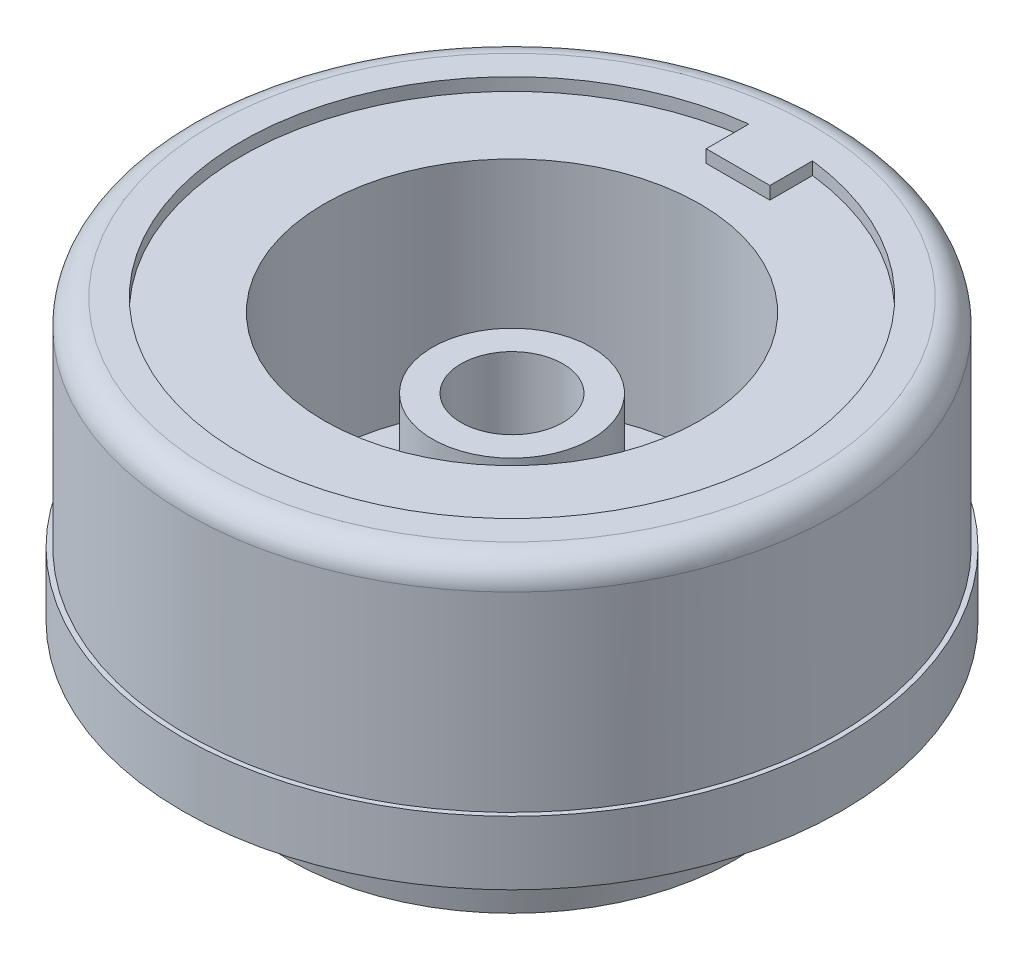
ISO-10303-21;
HEADER;
FILE_DESCRIPTION(('STEP AP214'),'2;1');
FILE_NAME('part.step','',(''),(''),'','','');
FILE_SCHEMA(('AUTOMOTIVE_DESIGN { 1 0 10303 214 1 1 1 1 }'));
ENDSEC;
DATA;
#1=APPLICATION_CONTEXT('core data for automotive mechanical design processes');
#2=APPLICATION_PROTOCOL_DEFINITION('international standard','automotive_design',2000,#1);
#3=PRODUCT_CONTEXT('',#1,'mechanical');
#4=PRODUCT('Part','Part','',(#3));
#5=PRODUCT_RELATED_PRODUCT_CATEGORY('part','',(#4));
#6=PRODUCT_DEFINITION_FORMATION('','',#4);
#7=PRODUCT_DEFINITION_CONTEXT('part definition',#1,'design');
#8=PRODUCT_DEFINITION('design','',#6,#7);
#9=PRODUCT_DEFINITION_SHAPE('','',#8);
#10=(LENGTH_UNIT() NAMED_UNIT(*) SI_UNIT(.MILLI.,.METRE.));
#11=(NAMED_UNIT(*) PLANE_ANGLE_UNIT() SI_UNIT($,.RADIAN.));
#12=(NAMED_UNIT(*) SI_UNIT($,.STERADIAN.) SOLID_ANGLE_UNIT());
#13=UNCERTAINTY_MEASURE_WITH_UNIT(LENGTH_MEASURE(1.E-05),#10,'distance_accuracy_value','');
#14=(GEOMETRIC_REPRESENTATION_CONTEXT(3) GLOBAL_UNCERTAINTY_ASSIGNED_CONTEXT((#13)) GLOBAL_UNIT_ASSIGNED_CONTEXT((#10,
#11,#12)) REPRESENTATION_CONTEXT('',''));
#15=CARTESIAN_POINT('',(0.,0.,0.));
#16=DIRECTION('',(0.,0.,1.));
#17=DIRECTION('',(1.,0.,0.));
#18=AXIS2_PLACEMENT_3D('',#15,#16,#17);
#19=CARTESIAN_POINT('',(9.525,12.963921875,0.));
#20=DIRECTION('',(0.,-1.,0.));
#21=DIRECTION('',(0.,0.,-1.));
#22=AXIS2_PLACEMENT_3D('',#19,#20,#21);
#23=PLANE('',#22);
#24=DIRECTION('',(0.,0.,-1.));
#25=VECTOR('',#24,1.);
#26=CARTESIAN_POINT('',(6.858,12.963921875,13.1455));
#27=LINE('',#26,#25);
#28=CARTESIAN_POINT('',(6.858,12.963921875,9.77157510332904));
#29=VERTEX_POINT('',#28);
#30=CARTESIAN_POINT('',(6.858,12.963921875,6.61010294927394));
#31=VERTEX_POINT('',#30);
#32=EDGE_CURVE('E188',#29,#31,#27,.T.);
#33=ORIENTED_EDGE('',*,*,#32,.T.);
#34=CARTESIAN_POINT('',(0.,12.963921875,0.));
#35=DIRECTION('',(0.,-1.,0.));
#36=DIRECTION('',(0.,0.,-1.));
#37=AXIS2_PLACEMENT_3D('',#34,#35,#36);
#38=CIRCLE('',#37,9.525);
#39=CARTESIAN_POINT('',(0.,12.963921875,9.525));
#40=VERTEX_POINT('',#39);
#41=EDGE_CURVE('E424',#40,#31,#38,.T.);
#42=ORIENTED_EDGE('',*,*,#41,.F.);
#43=DIRECTION('',(0.,0.,1.));
#44=VECTOR('',#43,1.);
#45=CARTESIAN_POINT('',(0.,12.963921875,0.));
#46=LINE('',#45,#44);
#47=CARTESIAN_POINT('',(0.,12.963921875,11.938));
#48=VERTEX_POINT('',#47);
#49=EDGE_CURVE('E949',#40,#48,#46,.T.);
#50=ORIENTED_EDGE('',*,*,#49,.T.);
#51=CARTESIAN_POINT('',(0.,12.963921875,0.));
#52=DIRECTION('',(0.,-1.,0.));
#53=DIRECTION('',(0.,0.,-1.));
#54=AXIS2_PLACEMENT_3D('',#51,#52,#53);
#55=CIRCLE('',#54,11.938);
#56=EDGE_CURVE('E173',#48,#29,#55,.T.);
#57=ORIENTED_EDGE('',*,*,#56,.T.);
#58=EDGE_LOOP('',(#33,#42,#50,#57));
#59=FACE_BOUND('',#58,.T.);
#60=ADVANCED_FACE('F43',(#59),#23,.T.);
#61=CARTESIAN_POINT('',(7.493,0.,0.));
#62=DIRECTION('',(0.,-1.,0.));
#63=DIRECTION('',(0.,0.,-1.));
#64=AXIS2_PLACEMENT_3D('',#61,#62,#63);
#65=PLANE('',#64);
#66=CARTESIAN_POINT('',(0.,0.,0.));
#67=DIRECTION('',(0.,-1.,0.));
#68=DIRECTION('',(0.,0.,-1.));
#69=AXIS2_PLACEMENT_3D('',#66,#67,#68);
#70=CIRCLE('',#69,8.89);
#71=CARTESIAN_POINT('',(-6.80185999428062,0.,5.72422925975234));
#72=VERTEX_POINT('',#71);
#73=CARTESIAN_POINT('',(-5.72422925975232,0.,6.80185999428064));
#74=VERTEX_POINT('',#73);
#75=EDGE_CURVE('E467',#72,#74,#70,.T.);
#76=ORIENTED_EDGE('',*,*,#75,.T.);
#77=DIRECTION('',(0.707106781186546,0.,-0.707106781186549));
#78=VECTOR('',#77,1.);
#79=CARTESIAN_POINT('',(-6.17478951387086,0.,7.25242024839918));
#80=LINE('',#79,#78);
#81=CARTESIAN_POINT('',(-4.73206714897541,0.,5.80969788350373));
#82=VERTEX_POINT('',#81);
#83=EDGE_CURVE('E253',#74,#82,#80,.T.);
#84=ORIENTED_EDGE('',*,*,#83,.T.);
#85=CARTESIAN_POINT('',(0.,0.,0.));
#86=DIRECTION('',(0.,-1.,0.));
#87=DIRECTION('',(0.,0.,-1.));
#88=AXIS2_PLACEMENT_3D('',#85,#86,#87);
#89=CIRCLE('',#88,7.493);
#90=CARTESIAN_POINT('',(-5.80969788350371,0.,4.73206714897543));
#91=VERTEX_POINT('',#90);
#92=EDGE_CURVE('E426',#91,#82,#89,.T.);
#93=ORIENTED_EDGE('',*,*,#92,.F.);
#94=DIRECTION('',(0.707106781186547,0.,-0.707106781186548));
#95=VECTOR('',#94,1.);
#96=CARTESIAN_POINT('',(-7.25242024839916,0.,6.17478951387088));
#97=LINE('',#96,#95);
#98=EDGE_CURVE('E247',#72,#91,#97,.T.);
#99=ORIENTED_EDGE('',*,*,#98,.F.);
#100=EDGE_LOOP('',(#76,#84,#93,#99));
#101=FACE_BOUND('',#100,.T.);
#102=ADVANCED_FACE('F331',(#101),#65,.T.);
#103=CARTESIAN_POINT('',(0.,0.,0.));
#104=DIRECTION('',(0.,-1.,0.));
#105=DIRECTION('',(0.,0.,-1.));
#106=AXIS2_PLACEMENT_3D('',#103,#104,#105);
#107=CYLINDRICAL_SURFACE('',#106,7.493);
#108=ORIENTED_EDGE('',*,*,#92,.T.);
#109=DIRECTION('',(0.,-1.,0.));
#110=VECTOR('',#109,1.);
#111=CARTESIAN_POINT('',(-4.73206714897541,6.86631753517413,5.80969788350373));
#112=LINE('',#111,#110);
#113=CARTESIAN_POINT('',(-4.73206714897541,3.302,5.80969788350373));
#114=VERTEX_POINT('',#113);
#115=EDGE_CURVE('E251',#114,#82,#112,.T.);
#116=ORIENTED_EDGE('',*,*,#115,.F.);
#117=CARTESIAN_POINT('',(0.,3.302,0.));
#118=DIRECTION('',(0.,-1.,0.));
#119=DIRECTION('',(0.,0.,-1.));
#120=AXIS2_PLACEMENT_3D('',#117,#118,#119);
#121=CIRCLE('',#120,7.493);
#122=CARTESIAN_POINT('',(-5.80969788350371,3.302,4.73206714897543));
#123=VERTEX_POINT('',#122);
#124=EDGE_CURVE('E429',#123,#114,#121,.T.);
#125=ORIENTED_EDGE('',*,*,#124,.F.);
#126=DIRECTION('',(0.,-1.,0.));
#127=VECTOR('',#126,1.);
#128=CARTESIAN_POINT('',(-5.80969788350371,6.86631753517413,4.73206714897543));
#129=LINE('',#128,#127);
#130=EDGE_CURVE('E256',#123,#91,#129,.T.);
#131=ORIENTED_EDGE('',*,*,#130,.T.);
#132=EDGE_LOOP('',(#108,#116,#125,#131));
#133=FACE_BOUND('',#132,.T.);
#134=ADVANCED_FACE('F337',(#133),#107,.F.);
#135=CARTESIAN_POINT('',(0.,1.905,0.));
#136=DIRECTION('',(0.,1.,0.));
#137=DIRECTION('',(0.,0.,1.));
#138=AXIS2_PLACEMENT_3D('',#135,#136,#137);
#139=CONICAL_SURFACE('',#138,9.144,0.132551532296673);
#140=CARTESIAN_POINT('',(-5.72421033391964,-0.000199999999999538,6.80184106844796));
#141=CARTESIAN_POINT('',(-5.75426130483428,0.317366100510191,6.8318920393626));
#142=CARTESIAN_POINT('',(-5.78431077987055,0.63493248409872,6.86194151439887));
#143=CARTESIAN_POINT('',(-5.84440673818632,1.27006581743205,6.92203747271464));
#144=CARTESIAN_POINT('',(-5.87445322146582,1.58763276717686,6.95208395599414));
#145=CARTESIAN_POINT('',(-5.90449820886695,1.9052,6.98212894339528));
#146=B_SPLINE_CURVE_WITH_KNOTS('',3,(#140,#141,#142,#143,#144,#145),.UNSPECIFIED.,.F.,.F.,(4,2,
4),(0.,0.961191525643388,1.92238305128557),.UNSPECIFIED.);
#147=CARTESIAN_POINT('',(-5.90447928687048,1.905,6.9821100213988));
#148=VERTEX_POINT('',#147);
#149=EDGE_CURVE('E271',#74,#148,#146,.T.);
#150=ORIENTED_EDGE('',*,*,#149,.F.);
#151=ORIENTED_EDGE('',*,*,#75,.F.);
#152=CARTESIAN_POINT('',(-6.80184106844794,-0.000200000000000001,5.72421033391967));
#153=CARTESIAN_POINT('',(-6.83189203936258,0.317366100510191,5.7542613048343));
#154=CARTESIAN_POINT('',(-6.86194151439885,0.63493248409872,5.78431077987057));
#155=CARTESIAN_POINT('',(-6.92203747271462,1.27006581743205,5.84440673818634));
#156=CARTESIAN_POINT('',(-6.95208395599412,1.58763276717686,5.87445322146584));
#157=CARTESIAN_POINT('',(-6.98212894339525,1.9052,5.90449820886698));
#158=B_SPLINE_CURVE_WITH_KNOTS('',3,(#152,#153,#154,#155,#156,#157),.UNSPECIFIED.,.F.,.F.,(4,2,
4),(0.,0.961191525643388,1.92238305128557),.UNSPECIFIED.);
#159=CARTESIAN_POINT('',(-6.98211002139878,1.905,5.9044792868705));
#160=VERTEX_POINT('',#159);
#161=EDGE_CURVE('E262',#72,#160,#158,.T.);
#162=ORIENTED_EDGE('',*,*,#161,.T.);
#163=CARTESIAN_POINT('',(0.,1.905,0.));
#164=DIRECTION('',(0.,-1.,0.));
#165=DIRECTION('',(0.,0.,-1.));
#166=AXIS2_PLACEMENT_3D('',#163,#164,#165);
#167=CIRCLE('',#166,9.144);
#168=EDGE_CURVE('E458',#160,#148,#167,.T.);
#169=ORIENTED_EDGE('',*,*,#168,.T.);
#170=EDGE_LOOP('',(#150,#151,#162,#169));
#171=FACE_BOUND('',#170,.T.);
#172=ADVANCED_FACE('F278',(#171),#139,.T.);
#173=CARTESIAN_POINT('',(0.,3.81992187499999,0.));
#174=DIRECTION('',(0.,1.,0.));
#175=DIRECTION('',(0.,0.,1.));
#176=AXIS2_PLACEMENT_3D('',#173,#174,#175);
#177=CONICAL_SURFACE('',#176,9.525,0.196398948659007);
#178=CARTESIAN_POINT('',(0.,3.81992187499999,0.));
#179=DIRECTION('',(0.,-1.,0.));
#180=DIRECTION('',(0.,0.,-1.));
#181=AXIS2_PLACEMENT_3D('',#178,#179,#180);
#182=CIRCLE('',#181,9.525);
#183=CARTESIAN_POINT('',(0.,3.81992187499999,-9.525));
#184=VERTEX_POINT('',#183);
#185=EDGE_CURVE('E454',#184,#184,#182,.T.);
#186=ORIENTED_EDGE('',*,*,#185,.T.);
#187=EDGE_LOOP('',(#186));
#188=FACE_BOUND('',#187,.T.);
#189=CARTESIAN_POINT('',(-5.90445105093719,1.9048,6.98208178546551));
#190=CARTESIAN_POINT('',(-5.9373316165662,2.13769909295494,7.01496235109452));
#191=CARTESIAN_POINT('',(-5.97021057583967,2.37059863943257,7.04784131036799));
#192=CARTESIAN_POINT('',(-6.03596528167542,2.83639863943257,7.11359601620374));
#193=CARTESIAN_POINT('',(-6.06884102823771,3.06929909295494,7.14647176276604));
#194=CARTESIAN_POINT('',(-6.10171516844446,3.3022,7.17934590297278));
#195=B_SPLINE_CURVE_WITH_KNOTS('',3,(#189,#190,#191,#192,#193,#194),.UNSPECIFIED.,.F.,.F.,(4,2,
4),(0.,0.712487372574213,1.4249747451464),.UNSPECIFIED.);
#196=CARTESIAN_POINT('',(-6.10168693824932,3.302,7.17931767277764));
#197=VERTEX_POINT('',#196);
#198=EDGE_CURVE('E52',#148,#197,#195,.T.);
#199=ORIENTED_EDGE('',*,*,#198,.F.);
#200=ORIENTED_EDGE('',*,*,#168,.F.);
#201=CARTESIAN_POINT('',(-6.98208178546549,1.9048,5.90445105093721));
#202=CARTESIAN_POINT('',(-7.0149623510945,2.13769909295494,5.93733161656622));
#203=CARTESIAN_POINT('',(-7.04784131036797,2.37059863943257,5.97021057583969));
#204=CARTESIAN_POINT('',(-7.11359601620373,2.83639863943257,6.03596528167545));
#205=CARTESIAN_POINT('',(-7.14647176276601,3.06929909295494,6.06884102823774));
#206=CARTESIAN_POINT('',(-7.17934590297276,3.3022,6.10171516844449));
#207=B_SPLINE_CURVE_WITH_KNOTS('',3,(#201,#202,#203,#204,#205,#206),.UNSPECIFIED.,.F.,.F.,(4,2,
4),(0.,0.712487372574213,1.4249747451464),.UNSPECIFIED.);
#208=CARTESIAN_POINT('',(-7.17931767277762,3.302,6.10168693824935));
#209=VERTEX_POINT('',#208);
#210=EDGE_CURVE('E293',#160,#209,#207,.T.);
#211=ORIENTED_EDGE('',*,*,#210,.T.);
#212=CARTESIAN_POINT('',(0.,3.302,0.));
#213=DIRECTION('',(0.,-1.,0.));
#214=DIRECTION('',(0.,0.,-1.));
#215=AXIS2_PLACEMENT_3D('',#212,#213,#214);
#216=CIRCLE('',#215,9.42195233160622);
#217=EDGE_CURVE('E300',#197,#209,#216,.T.);
#218=ORIENTED_EDGE('',*,*,#217,.F.);
#219=EDGE_LOOP('',(#199,#200,#211,#218));
#220=FACE_BOUND('',#219,.T.);
#221=ADVANCED_FACE('F306',(#188,#220),#177,.T.);
#222=CARTESIAN_POINT('',(0.,0.,0.));
#223=DIRECTION('',(0.,-1.,0.));
#224=DIRECTION('',(0.,0.,-1.));
#225=AXIS2_PLACEMENT_3D('',#222,#223,#224);
#226=CYLINDRICAL_SURFACE('',#225,7.493);
#227=CARTESIAN_POINT('',(0.,14.478,0.));
#228=DIRECTION('',(0.,1.,0.));
#229=DIRECTION('',(0.,0.,1.));
#230=AXIS2_PLACEMENT_3D('',#227,#228,#229);
#231=CIRCLE('',#230,7.493);
#232=CARTESIAN_POINT('',(0.,14.478,7.493));
#233=VERTEX_POINT('',#232);
#234=EDGE_CURVE('E470',#233,#233,#231,.T.);
#235=ORIENTED_EDGE('',*,*,#234,.T.);
#236=EDGE_LOOP('',(#235));
#237=FACE_BOUND('',#236,.T.);
#238=CARTESIAN_POINT('',(0.,5.842,0.));
#239=DIRECTION('',(0.,-1.,0.));
#240=DIRECTION('',(0.,0.,-1.));
#241=AXIS2_PLACEMENT_3D('',#238,#239,#240);
#242=CIRCLE('',#241,7.493);
#243=CARTESIAN_POINT('',(0.,5.842,-7.493));
#244=VERTEX_POINT('',#243);
#245=EDGE_CURVE('E406',#244,#244,#242,.T.);
#246=ORIENTED_EDGE('',*,*,#245,.T.);
#247=EDGE_LOOP('',(#246));
#248=FACE_BOUND('',#247,.T.);
#249=ADVANCED_FACE('F310',(#237,#248),#226,.F.);
#250=CARTESIAN_POINT('',(0.,0.,0.));
#251=DIRECTION('',(0.,-1.,0.));
#252=DIRECTION('',(0.,0.,-1.));
#253=AXIS2_PLACEMENT_3D('',#250,#251,#252);
#254=CYLINDRICAL_SURFACE('',#253,12.954);
#255=CARTESIAN_POINT('',(0.,13.97,0.));
#256=DIRECTION('',(0.,1.,0.));
#257=DIRECTION('',(0.,0.,1.));
#258=AXIS2_PLACEMENT_3D('',#255,#256,#257);
#259=CIRCLE('',#258,12.954);
#260=CARTESIAN_POINT('',(0.,13.97,12.954));
#261=VERTEX_POINT('',#260);
#262=EDGE_CURVE('E398',#261,#261,#259,.F.);
#263=ORIENTED_EDGE('',*,*,#262,.T.);
#264=EDGE_LOOP('',(#263));
#265=FACE_BOUND('',#264,.T.);
#266=CARTESIAN_POINT('',(0.,6.35992187499999,0.));
#267=DIRECTION('',(0.,-1.,0.));
#268=DIRECTION('',(0.,0.,-1.));
#269=AXIS2_PLACEMENT_3D('',#266,#267,#268);
#270=CIRCLE('',#269,12.954);
#271=CARTESIAN_POINT('',(0.,6.35992187499999,-12.954));
#272=VERTEX_POINT('',#271);
#273=EDGE_CURVE('E418',#272,#272,#270,.T.);
#274=ORIENTED_EDGE('',*,*,#273,.F.);
#275=EDGE_LOOP('',(#274));
#276=FACE_BOUND('',#275,.T.);
#277=ADVANCED_FACE('F379',(#265,#276),#254,.T.);
#278=CARTESIAN_POINT('',(12.954,14.986,0.));
#279=DIRECTION('',(0.,1.,0.));
#280=DIRECTION('',(0.,0.,1.));
#281=AXIS2_PLACEMENT_3D('',#278,#279,#280);
#282=PLANE('',#281);
#283=DIRECTION('',(0.,0.,-1.));
#284=VECTOR('',#283,1.);
#285=CARTESIAN_POINT('',(1.27,14.986,-9.017));
#286=LINE('',#285,#284);
#287=CARTESIAN_POINT('',(1.27,14.986,-9.017));
#288=VERTEX_POINT('',#287);
#289=CARTESIAN_POINT('',(1.27,14.986,-10.7200338152452));
#290=VERTEX_POINT('',#289);
#291=EDGE_CURVE('E486',#288,#290,#286,.T.);
#292=ORIENTED_EDGE('',*,*,#291,.T.);
#293=CARTESIAN_POINT('',(0.,14.986,0.));
#294=DIRECTION('',(0.,1.,0.));
#295=DIRECTION('',(0.,0.,1.));
#296=AXIS2_PLACEMENT_3D('',#293,#294,#295);
#297=CIRCLE('',#296,10.795);
#298=CARTESIAN_POINT('',(-1.27,14.986,-10.7200338152452));
#299=VERTEX_POINT('',#298);
#300=EDGE_CURVE('E473',#299,#290,#297,.T.);
#301=ORIENTED_EDGE('',*,*,#300,.F.);
#302=DIRECTION('',(0.,0.,1.));
#303=VECTOR('',#302,1.);
#304=CARTESIAN_POINT('',(-1.27,14.986,-10.7200338152452));
#305=LINE('',#304,#303);
#306=CARTESIAN_POINT('',(-1.27,14.986,-9.017));
#307=VERTEX_POINT('',#306);
#308=EDGE_CURVE('E477',#299,#307,#305,.T.);
#309=ORIENTED_EDGE('',*,*,#308,.T.);
#310=DIRECTION('',(1.,0.,0.));
#311=VECTOR('',#310,1.);
#312=CARTESIAN_POINT('',(-1.27,14.986,-9.017));
#313=LINE('',#312,#311);
#314=EDGE_CURVE('E489',#307,#288,#313,.T.);
#315=ORIENTED_EDGE('',*,*,#314,.T.);
#316=EDGE_LOOP('',(#292,#301,#309,#315));
#317=FACE_BOUND('',#316,.T.);
#318=CARTESIAN_POINT('',(0.,14.986,0.));
#319=DIRECTION('',(0.,1.,0.));
#320=DIRECTION('',(0.,0.,1.));
#321=AXIS2_PLACEMENT_3D('',#318,#319,#320);
#322=CIRCLE('',#321,11.938);
#323=CARTESIAN_POINT('',(0.,14.986,11.938));
#324=VERTEX_POINT('',#323);
#325=EDGE_CURVE('E401',#324,#324,#322,.T.);
#326=ORIENTED_EDGE('',*,*,#325,.T.);
#327=EDGE_LOOP('',(#326));
#328=FACE_BOUND('',#327,.T.);
#329=ADVANCED_FACE('F375',(#317,#328),#282,.T.);
#330=CARTESIAN_POINT('',(7.493,5.842,0.));
#331=DIRECTION('',(0.,1.,0.));
#332=DIRECTION('',(0.,0.,1.));
#333=AXIS2_PLACEMENT_3D('',#330,#331,#332);
#334=PLANE('',#333);
#335=CARTESIAN_POINT('',(0.,5.842,0.));
#336=DIRECTION('',(0.,-1.,0.));
#337=DIRECTION('',(0.,0.,-1.));
#338=AXIS2_PLACEMENT_3D('',#335,#336,#337);
#339=CIRCLE('',#338,3.175);
#340=CARTESIAN_POINT('',(0.,5.842,-3.175));
#341=VERTEX_POINT('',#340);
#342=EDGE_CURVE('E438',#341,#341,#339,.T.);
#343=ORIENTED_EDGE('',*,*,#342,.T.);
#344=EDGE_LOOP('',(#343));
#345=FACE_BOUND('',#344,.T.);
#346=ORIENTED_EDGE('',*,*,#245,.F.);
#347=EDGE_LOOP('',(#346));
#348=FACE_BOUND('',#347,.T.);
#349=ADVANCED_FACE('F371',(#345,#348),#334,.T.);
#350=CARTESIAN_POINT('',(0.,0.,0.));
#351=DIRECTION('',(0.,-1.,0.));
#352=DIRECTION('',(0.,0.,-1.));
#353=AXIS2_PLACEMENT_3D('',#350,#351,#352);
#354=CYLINDRICAL_SURFACE('',#353,3.175);
#355=CARTESIAN_POINT('',(0.,11.684,0.));
#356=DIRECTION('',(0.,-1.,0.));
#357=DIRECTION('',(0.,0.,-1.));
#358=AXIS2_PLACEMENT_3D('',#355,#356,#357);
#359=CIRCLE('',#358,3.175);
#360=CARTESIAN_POINT('',(0.,11.684,-3.175));
#361=VERTEX_POINT('',#360);
#362=EDGE_CURVE('E435',#361,#361,#359,.T.);
#363=ORIENTED_EDGE('',*,*,#362,.T.);
#364=EDGE_LOOP('',(#363));
#365=FACE_BOUND('',#364,.T.);
#366=ORIENTED_EDGE('',*,*,#342,.F.);
#367=EDGE_LOOP('',(#366));
#368=FACE_BOUND('',#367,.T.);
#369=ADVANCED_FACE('F367',(#365,#368),#354,.T.);
#370=CARTESIAN_POINT('',(3.175,11.684,0.));
#371=DIRECTION('',(0.,1.,0.));
#372=DIRECTION('',(0.,0.,1.));
#373=AXIS2_PLACEMENT_3D('',#370,#371,#372);
#374=PLANE('',#373);
#375=CARTESIAN_POINT('',(0.,11.684,0.));
#376=DIRECTION('',(0.,-1.,0.));
#377=DIRECTION('',(0.,0.,-1.));
#378=AXIS2_PLACEMENT_3D('',#375,#376,#377);
#379=CIRCLE('',#378,2.032);
#380=CARTESIAN_POINT('',(0.,11.684,-2.032));
#381=VERTEX_POINT('',#380);
#382=EDGE_CURVE('E432',#381,#381,#379,.T.);
#383=ORIENTED_EDGE('',*,*,#382,.T.);
#384=EDGE_LOOP('',(#383));
#385=FACE_BOUND('',#384,.T.);
#386=ORIENTED_EDGE('',*,*,#362,.F.);
#387=EDGE_LOOP('',(#386));
#388=FACE_BOUND('',#387,.T.);
#389=ADVANCED_FACE('F363',(#385,#388),#374,.T.);
#390=CARTESIAN_POINT('',(0.,0.,0.));
#391=DIRECTION('',(0.,-1.,0.));
#392=DIRECTION('',(0.,0.,-1.));
#393=AXIS2_PLACEMENT_3D('',#390,#391,#392);
#394=CYLINDRICAL_SURFACE('',#393,2.032);
#395=ORIENTED_EDGE('',*,*,#382,.F.);
#396=EDGE_LOOP('',(#395));
#397=FACE_BOUND('',#396,.T.);
#398=CARTESIAN_POINT('',(0.,3.048,0.));
#399=DIRECTION('',(0.,-1.,0.));
#400=DIRECTION('',(0.,0.,-1.));
#401=AXIS2_PLACEMENT_3D('',#398,#399,#400);
#402=CIRCLE('',#401,2.032);
#403=CARTESIAN_POINT('',(0.,3.048,-2.032));
#404=VERTEX_POINT('',#403);
#405=EDGE_CURVE('E452',#404,#404,#402,.T.);
#406=ORIENTED_EDGE('',*,*,#405,.T.);
#407=EDGE_LOOP('',(#406));
#408=FACE_BOUND('',#407,.T.);
#409=ADVANCED_FACE('F353',(#397,#408),#394,.F.);
#410=CARTESIAN_POINT('',(2.032,3.302,0.));
#411=DIRECTION('',(0.,-1.,0.));
#412=DIRECTION('',(0.,0.,-1.));
#413=AXIS2_PLACEMENT_3D('',#410,#411,#412);
#414=PLANE('',#413);
#415=CARTESIAN_POINT('',(0.,3.302,0.));
#416=DIRECTION('',(0.,-1.,0.));
#417=DIRECTION('',(0.,0.,-1.));
#418=AXIS2_PLACEMENT_3D('',#415,#416,#417);
#419=CIRCLE('',#418,5.969);
#420=CARTESIAN_POINT('',(0.,3.302,-5.969));
#421=VERTEX_POINT('',#420);
#422=EDGE_CURVE('E403',#421,#421,#419,.T.);
#423=ORIENTED_EDGE('',*,*,#422,.F.);
#424=EDGE_LOOP('',(#423));
#425=FACE_BOUND('',#424,.T.);
#426=ORIENTED_EDGE('',*,*,#124,.T.);
#427=DIRECTION('',(-0.707106781186546,0.,0.707106781186549));
#428=VECTOR('',#427,1.);
#429=CARTESIAN_POINT('',(-6.17478951387086,3.302,7.25242024839918));
#430=LINE('',#429,#428);
#431=EDGE_CURVE('E248',#114,#197,#430,.T.);
#432=ORIENTED_EDGE('',*,*,#431,.T.);
#433=ORIENTED_EDGE('',*,*,#217,.T.);
#434=DIRECTION('',(-0.707106781186547,0.,0.707106781186548));
#435=VECTOR('',#434,1.);
#436=CARTESIAN_POINT('',(-7.25242024839916,3.302,6.17478951387088));
#437=LINE('',#436,#435);
#438=EDGE_CURVE('E250',#123,#209,#437,.T.);
#439=ORIENTED_EDGE('',*,*,#438,.F.);
#440=EDGE_LOOP('',(#426,#432,#433,#439));
#441=FACE_BOUND('',#440,.T.);
#442=ADVANCED_FACE('F349',(#425,#441),#414,.T.);
#443=CARTESIAN_POINT('',(0.,0.,0.));
#444=DIRECTION('',(0.,-1.,0.));
#445=DIRECTION('',(0.,0.,-1.));
#446=AXIS2_PLACEMENT_3D('',#443,#444,#445);
#447=CYLINDRICAL_SURFACE('',#446,9.525);
#448=DIRECTION('',(0.,-1.,0.));
#449=VECTOR('',#448,1.);
#450=CARTESIAN_POINT('',(6.858,0.,6.61010294927393));
#451=LINE('',#450,#449);
#452=CARTESIAN_POINT('',(6.858,6.86792187500002,6.61010294927393));
#453=VERTEX_POINT('',#452);
#454=EDGE_CURVE('E59',#453,#31,#451,.F.);
#455=ORIENTED_EDGE('',*,*,#454,.F.);
#456=CARTESIAN_POINT('',(0.,6.86792187500002,0.));
#457=DIRECTION('',(0.,1.,0.));
#458=DIRECTION('',(0.,0.,1.));
#459=AXIS2_PLACEMENT_3D('',#456,#457,#458);
#460=CIRCLE('',#459,9.525);
#461=CARTESIAN_POINT('',(5.334,6.86792187500002,7.89139208251624));
#462=VERTEX_POINT('',#461);
#463=EDGE_CURVE('E64',#462,#453,#460,.T.);
#464=ORIENTED_EDGE('',*,*,#463,.F.);
#465=DIRECTION('',(0.,-1.,0.));
#466=VECTOR('',#465,1.);
#467=CARTESIAN_POINT('',(5.334,0.,7.89139208251624));
#468=LINE('',#467,#466);
#469=CARTESIAN_POINT('',(5.334,12.963921875,7.89139208251624));
#470=VERTEX_POINT('',#469);
#471=EDGE_CURVE('E955',#470,#462,#468,.T.);
#472=ORIENTED_EDGE('',*,*,#471,.F.);
#473=CARTESIAN_POINT('',(1.524,12.963921875,9.40228956159084));
#474=VERTEX_POINT('',#473);
#475=EDGE_CURVE('E180',#470,#474,#38,.T.);
#476=ORIENTED_EDGE('',*,*,#475,.T.);
#477=DIRECTION('',(0.,-1.,0.));
#478=VECTOR('',#477,1.);
#479=CARTESIAN_POINT('',(1.524,0.,9.40228956159084));
#480=LINE('',#479,#478);
#481=CARTESIAN_POINT('',(1.524,6.86792187499999,9.40228956159084));
#482=VERTEX_POINT('',#481);
#483=EDGE_CURVE('E242',#482,#474,#480,.F.);
#484=ORIENTED_EDGE('',*,*,#483,.F.);
#485=CARTESIAN_POINT('',(0.,6.86792187499999,0.));
#486=DIRECTION('',(0.,-1.,0.));
#487=DIRECTION('',(0.,0.,-1.));
#488=AXIS2_PLACEMENT_3D('',#485,#486,#487);
#489=CIRCLE('',#488,9.525);
#490=CARTESIAN_POINT('',(0.,6.86792187499999,9.525));
#491=VERTEX_POINT('',#490);
#492=EDGE_CURVE('E245',#491,#482,#489,.F.);
#493=ORIENTED_EDGE('',*,*,#492,.F.);
#494=DIRECTION('',(0.,-1.,0.));
#495=VECTOR('',#494,1.);
#496=CARTESIAN_POINT('',(0.,0.,9.525));
#497=LINE('',#496,#495);
#498=EDGE_CURVE('E239',#491,#40,#497,.F.);
#499=ORIENTED_EDGE('',*,*,#498,.T.);
#500=ORIENTED_EDGE('',*,*,#41,.T.);
#501=EDGE_LOOP('',(#455,#464,#472,#476,#484,#493,#499,#500));
#502=FACE_BOUND('',#501,.T.);
#503=ORIENTED_EDGE('',*,*,#185,.F.);
#504=EDGE_LOOP('',(#503));
#505=FACE_BOUND('',#504,.T.);
#506=ADVANCED_FACE('F343',(#502,#505),#447,.T.);
#507=DIRECTION('',(0.,0.,-1.));
#508=VECTOR('',#507,1.);
#509=CARTESIAN_POINT('',(5.334,12.963921875,13.1455));
#510=LINE('',#509,#508);
#511=CARTESIAN_POINT('',(5.334,12.963921875,10.6800883891473));
#512=VERTEX_POINT('',#511);
#513=EDGE_CURVE('E178',#512,#470,#510,.T.);
#514=ORIENTED_EDGE('',*,*,#513,.F.);
#515=CARTESIAN_POINT('',(1.524,12.963921875,11.8403238131396));
#516=VERTEX_POINT('',#515);
#517=EDGE_CURVE('E162',#512,#516,#55,.T.);
#518=ORIENTED_EDGE('',*,*,#517,.T.);
#519=DIRECTION('',(0.,0.,1.));
#520=VECTOR('',#519,1.);
#521=CARTESIAN_POINT('',(1.524,12.963921875,0.));
#522=LINE('',#521,#520);
#523=EDGE_CURVE('E238',#474,#516,#522,.T.);
#524=ORIENTED_EDGE('',*,*,#523,.F.);
#525=ORIENTED_EDGE('',*,*,#475,.F.);
#526=EDGE_LOOP('',(#514,#518,#524,#525));
#527=FACE_BOUND('',#526,.T.);
#528=ADVANCED_FACE('F179',(#527),#23,.T.);
#529=CARTESIAN_POINT('',(0.,12.963921875,0.));
#530=DIRECTION('',(0.,-1.,0.));
#531=DIRECTION('',(0.,0.,-1.));
#532=AXIS2_PLACEMENT_3D('',#529,#530,#531);
#533=CONICAL_SURFACE('',#532,11.938,0.0349065850398867);
#534=CARTESIAN_POINT('',(6.858,-5.72010347816264,10.5587656794319));
#535=CARTESIAN_POINT('',(6.858,-3.49653561043503,10.4661747788413));
#536=CARTESIAN_POINT('',(6.858,-1.27298264079779,10.3732255546477));
#537=CARTESIAN_POINT('',(6.858,3.17409012657347,10.1865447904481));
#538=CARTESIAN_POINT('',(6.858,5.39760992431231,10.092813250557));
#539=CARTESIAN_POINT('',(6.858,9.84461367723485,9.90450215699885));
#540=CARTESIAN_POINT('',(6.858,12.0680976324177,9.80992260331236));
#541=CARTESIAN_POINT('',(6.858,16.5150262427414,9.61983655845105));
#542=CARTESIAN_POINT('',(6.858,18.7384708978764,9.52433006713981));
#543=CARTESIAN_POINT('',(6.858,20.9618938723972,9.42832065800642));
#544=B_SPLINE_CURVE_WITH_KNOTS('',3,(#534,#535,#536,#537,#538,#539,#540,#541,#542,#543),
.UNSPECIFIED.,.F.,.F.,(4,2,2,2,4),(0.,6.67648442550126,13.3529678687095,20.0294514643755,
26.7059360426302),.UNSPECIFIED.);
#545=CARTESIAN_POINT('',(6.858,6.86792187500002,10.0305357848978));
#546=VERTEX_POINT('',#545);
#547=EDGE_CURVE('E183',#546,#29,#544,.T.);
#548=ORIENTED_EDGE('',*,*,#547,.T.);
#549=ORIENTED_EDGE('',*,*,#56,.F.);
#550=DIRECTION('',(0.,-0.999390827019096,0.034899496702501));
#551=VECTOR('',#550,1.);
#552=CARTESIAN_POINT('',(0.,354.823513566446,0.));
#553=LINE('',#552,#551);
#554=CARTESIAN_POINT('',(0.,6.86792187500002,12.1508770108217));
#555=VERTEX_POINT('',#554);
#556=EDGE_CURVE('E950',#48,#555,#553,.T.);
#557=ORIENTED_EDGE('',*,*,#556,.T.);
#558=CARTESIAN_POINT('',(0.,6.86792187499999,0.));
#559=DIRECTION('',(0.,-1.,0.));
#560=DIRECTION('',(0.,0.,-1.));
#561=AXIS2_PLACEMENT_3D('',#558,#559,#560);
#562=CIRCLE('',#561,12.1508770108217);
#563=CARTESIAN_POINT('',(1.524,6.86792187499999,12.0549258036752));
#564=VERTEX_POINT('',#563);
#565=EDGE_CURVE('E11',#564,#555,#562,.T.);
#566=ORIENTED_EDGE('',*,*,#565,.F.);
#567=CARTESIAN_POINT('',(1.524,33.2688293209415,11.1250370929294));
#568=CARTESIAN_POINT('',(1.524,25.516986648752,11.3982433906526));
#569=CARTESIAN_POINT('',(1.524,17.7651386836998,11.6712993452089));
#570=CARTESIAN_POINT('',(1.524,2.26143216827017,12.2171105679733));
#571=CARTESIAN_POINT('',(1.524,-5.49042638210737,12.4898658361816));
#572=CARTESIAN_POINT('',(1.524,-13.2422902253475,12.7624707612228));
#573=B_SPLINE_CURVE_WITH_KNOTS('',3,(#567,#568,#569,#570,#571,#572),.UNSPECIFIED.,.F.,.F.,(4,2,
4),(0.,23.2699668639303,46.5399337266606),.UNSPECIFIED.);
#574=EDGE_CURVE('E169',#516,#564,#573,.T.);
#575=ORIENTED_EDGE('',*,*,#574,.F.);
#576=ORIENTED_EDGE('',*,*,#517,.F.);
#577=CARTESIAN_POINT('',(5.334,20.9994470535849,10.3654841674738));
#578=CARTESIAN_POINT('',(5.334,18.7756667705255,10.4528184539526));
#579=CARTESIAN_POINT('',(5.334,16.5518774761509,10.539923123665));
#580=CARTESIAN_POINT('',(5.334,12.1042822139591,10.7137039235395));
#581=CARTESIAN_POINT('',(5.334,9.88047624614241,10.8003800537155));
#582=CARTESIAN_POINT('',(5.334,5.43284885211657,10.9733344737678));
#583=CARTESIAN_POINT('',(5.334,3.20902742590746,11.0596127636457));
#584=CARTESIAN_POINT('',(5.334,-1.23862987812385,11.2317979235096));
#585=CARTESIAN_POINT('',(5.334,-3.46246575594651,11.3177047934835));
#586=CARTESIAN_POINT('',(5.334,-5.68630827976331,11.4034391607436));
#587=B_SPLINE_CURVE_WITH_KNOTS('',3,(#577,#578,#579,#580,#581,#582,#583,#584,#585,#586),
.UNSPECIFIED.,.F.,.F.,(4,2,2,2,4),(0.,6.67648365105792,13.3529670866938,20.0294504942095,
26.7059341171064),.UNSPECIFIED.);
#588=CARTESIAN_POINT('',(5.334,6.86792187500002,10.9175206036955));
#589=VERTEX_POINT('',#588);
#590=EDGE_CURVE('E166',#512,#589,#587,.T.);
#591=ORIENTED_EDGE('',*,*,#590,.T.);
#592=CARTESIAN_POINT('',(0.,6.86792187500002,0.));
#593=DIRECTION('',(0.,-1.,0.));
#594=DIRECTION('',(0.,0.,-1.));
#595=AXIS2_PLACEMENT_3D('',#592,#593,#594);
#596=CIRCLE('',#595,12.1508770108217);
#597=EDGE_CURVE('E189',#589,#546,#596,.F.);
#598=ORIENTED_EDGE('',*,*,#597,.T.);
#599=EDGE_LOOP('',(#548,#549,#557,#566,#575,#576,#591,#598));
#600=FACE_BOUND('',#599,.T.);
#601=CARTESIAN_POINT('',(0.,3.81992187499999,0.));
#602=DIRECTION('',(0.,-1.,0.));
#603=DIRECTION('',(0.,0.,-1.));
#604=AXIS2_PLACEMENT_3D('',#601,#602,#603);
#605=CIRCLE('',#604,12.2573155162325);
#606=CARTESIAN_POINT('',(0.,3.81992187499999,-12.2573155162325));
#607=VERTEX_POINT('',#606);
#608=EDGE_CURVE('E174',#607,#607,#605,.T.);
#609=ORIENTED_EDGE('',*,*,#608,.T.);
#610=EDGE_LOOP('',(#609));
#611=FACE_BOUND('',#610,.T.);
#612=ADVANCED_FACE('F45',(#600,#611),#533,.F.);
#613=CARTESIAN_POINT('',(11.938,3.81992187499999,0.));
#614=DIRECTION('',(0.,-1.,0.));
#615=DIRECTION('',(0.,0.,-1.));
#616=AXIS2_PLACEMENT_3D('',#613,#614,#615);
#617=PLANE('',#616);
#618=ORIENTED_EDGE('',*,*,#608,.F.);
#619=EDGE_LOOP('',(#618));
#620=FACE_BOUND('',#619,.T.);
#621=CARTESIAN_POINT('',(0.,3.81992187499999,0.));
#622=DIRECTION('',(0.,-1.,0.));
#623=DIRECTION('',(0.,0.,-1.));
#624=AXIS2_PLACEMENT_3D('',#621,#622,#623);
#625=CIRCLE('',#624,13.1445);
#626=CARTESIAN_POINT('',(0.,3.81992187499999,-13.1445));
#627=VERTEX_POINT('',#626);
#628=EDGE_CURVE('E414',#627,#627,#625,.T.);
#629=ORIENTED_EDGE('',*,*,#628,.T.);
#630=EDGE_LOOP('',(#629));
#631=FACE_BOUND('',#630,.T.);
#632=ADVANCED_FACE('F348',(#620,#631),#617,.T.);
#633=CARTESIAN_POINT('',(0.,13.97,0.));
#634=DIRECTION('',(0.,1.,0.));
#635=DIRECTION('',(0.,0.,1.));
#636=AXIS2_PLACEMENT_3D('',#633,#634,#635);
#637=TOROIDAL_SURFACE('',#636,11.938,1.016);
#638=ORIENTED_EDGE('',*,*,#262,.F.);
#639=EDGE_LOOP('',(#638));
#640=FACE_BOUND('',#639,.T.);
#641=ORIENTED_EDGE('',*,*,#325,.F.);
#642=EDGE_LOOP('',(#641));
#643=FACE_BOUND('',#642,.T.);
#644=ADVANCED_FACE('F383',(#640,#643),#637,.T.);
#645=CARTESIAN_POINT('',(0.,6.35992187499999,0.));
#646=DIRECTION('',(0.,-1.,0.));
#647=DIRECTION('',(0.,0.,-1.));
#648=AXIS2_PLACEMENT_3D('',#645,#646,#647);
#649=CYLINDRICAL_SURFACE('',#648,13.1445);
#650=CARTESIAN_POINT('',(0.,6.35992187499999,0.));
#651=DIRECTION('',(0.,-1.,0.));
#652=DIRECTION('',(0.,0.,-1.));
#653=AXIS2_PLACEMENT_3D('',#650,#651,#652);
#654=CIRCLE('',#653,13.1445);
#655=CARTESIAN_POINT('',(0.,6.35992187499999,-13.1445));
#656=VERTEX_POINT('',#655);
#657=EDGE_CURVE('E411',#656,#656,#654,.T.);
#658=ORIENTED_EDGE('',*,*,#657,.T.);
#659=EDGE_LOOP('',(#658));
#660=FACE_BOUND('',#659,.T.);
#661=ORIENTED_EDGE('',*,*,#628,.F.);
#662=EDGE_LOOP('',(#661));
#663=FACE_BOUND('',#662,.T.);
#664=ADVANCED_FACE('F385',(#660,#663),#649,.T.);
#665=CARTESIAN_POINT('',(0.,6.35992187499999,0.));
#666=DIRECTION('',(0.,-1.,0.));
#667=DIRECTION('',(0.,0.,-1.));
#668=AXIS2_PLACEMENT_3D('',#665,#666,#667);
#669=PLANE('',#668);
#670=ORIENTED_EDGE('',*,*,#273,.T.);
#671=EDGE_LOOP('',(#670));
#672=FACE_BOUND('',#671,.T.);
#673=ORIENTED_EDGE('',*,*,#657,.F.);
#674=EDGE_LOOP('',(#673));
#675=FACE_BOUND('',#674,.T.);
#676=ADVANCED_FACE('F391',(#672,#675),#669,.F.);
#677=CARTESIAN_POINT('',(0.,14.478,0.));
#678=DIRECTION('',(0.,1.,0.));
#679=DIRECTION('',(0.,0.,1.));
#680=AXIS2_PLACEMENT_3D('',#677,#678,#679);
#681=CYLINDRICAL_SURFACE('',#680,10.795);
#682=ORIENTED_EDGE('',*,*,#300,.T.);
#683=DIRECTION('',(0.,1.,0.));
#684=VECTOR('',#683,1.);
#685=CARTESIAN_POINT('',(1.27,14.478,-10.7200338152452));
#686=LINE('',#685,#684);
#687=CARTESIAN_POINT('',(1.27,14.478,-10.7200338152452));
#688=VERTEX_POINT('',#687);
#689=EDGE_CURVE('E484',#688,#290,#686,.T.);
#690=ORIENTED_EDGE('',*,*,#689,.F.);
#691=CARTESIAN_POINT('',(0.,14.478,0.));
#692=DIRECTION('',(0.,1.,0.));
#693=DIRECTION('',(0.,0.,1.));
#694=AXIS2_PLACEMENT_3D('',#691,#692,#693);
#695=CIRCLE('',#694,10.795);
#696=CARTESIAN_POINT('',(-1.27,14.478,-10.7200338152452));
#697=VERTEX_POINT('',#696);
#698=EDGE_CURVE('E474',#697,#688,#695,.T.);
#699=ORIENTED_EDGE('',*,*,#698,.F.);
#700=DIRECTION('',(0.,1.,0.));
#701=VECTOR('',#700,1.);
#702=CARTESIAN_POINT('',(-1.27,14.478,-10.7200338152452));
#703=LINE('',#702,#701);
#704=EDGE_CURVE('E493',#697,#299,#703,.T.);
#705=ORIENTED_EDGE('',*,*,#704,.T.);
#706=EDGE_LOOP('',(#682,#690,#699,#705));
#707=FACE_BOUND('',#706,.T.);
#708=ADVANCED_FACE('F517',(#707),#681,.F.);
#709=CARTESIAN_POINT('',(-1.27,14.478,-10.7200338152452));
#710=DIRECTION('',(-1.,0.,0.));
#711=DIRECTION('',(0.,0.,1.));
#712=AXIS2_PLACEMENT_3D('',#709,#710,#711);
#713=PLANE('',#712);
#714=ORIENTED_EDGE('',*,*,#308,.F.);
#715=ORIENTED_EDGE('',*,*,#704,.F.);
#716=DIRECTION('',(0.,0.,1.));
#717=VECTOR('',#716,1.);
#718=CARTESIAN_POINT('',(-1.27,14.478,-10.7200338152452));
#719=LINE('',#718,#717);
#720=CARTESIAN_POINT('',(-1.27,14.478,-9.017));
#721=VERTEX_POINT('',#720);
#722=EDGE_CURVE('E482',#697,#721,#719,.T.);
#723=ORIENTED_EDGE('',*,*,#722,.T.);
#724=DIRECTION('',(0.,1.,0.));
#725=VECTOR('',#724,1.);
#726=CARTESIAN_POINT('',(-1.27,14.478,-9.017));
#727=LINE('',#726,#725);
#728=EDGE_CURVE('E495',#721,#307,#727,.T.);
#729=ORIENTED_EDGE('',*,*,#728,.T.);
#730=EDGE_LOOP('',(#714,#715,#723,#729));
#731=FACE_BOUND('',#730,.T.);
#732=ADVANCED_FACE('F519',(#731),#713,.T.);
#733=CARTESIAN_POINT('',(-1.27,14.478,-9.017));
#734=DIRECTION('',(0.,0.,1.));
#735=DIRECTION('',(1.,0.,0.));
#736=AXIS2_PLACEMENT_3D('',#733,#734,#735);
#737=PLANE('',#736);
#738=DIRECTION('',(0.,1.,0.));
#739=VECTOR('',#738,1.);
#740=CARTESIAN_POINT('',(1.27,14.478,-9.017));
#741=LINE('',#740,#739);
#742=CARTESIAN_POINT('',(1.27,14.478,-9.017));
#743=VERTEX_POINT('',#742);
#744=EDGE_CURVE('E497',#743,#288,#741,.T.);
#745=ORIENTED_EDGE('',*,*,#744,.T.);
#746=ORIENTED_EDGE('',*,*,#314,.F.);
#747=ORIENTED_EDGE('',*,*,#728,.F.);
#748=DIRECTION('',(1.,0.,0.));
#749=VECTOR('',#748,1.);
#750=CARTESIAN_POINT('',(-1.27,14.478,-9.017));
#751=LINE('',#750,#749);
#752=EDGE_CURVE('E480',#721,#743,#751,.T.);
#753=ORIENTED_EDGE('',*,*,#752,.T.);
#754=EDGE_LOOP('',(#745,#746,#747,#753));
#755=FACE_BOUND('',#754,.T.);
#756=ADVANCED_FACE('F513',(#755),#737,.T.);
#757=CARTESIAN_POINT('',(1.27,14.478,-9.017));
#758=DIRECTION('',(1.,0.,0.));
#759=DIRECTION('',(0.,0.,-1.));
#760=AXIS2_PLACEMENT_3D('',#757,#758,#759);
#761=PLANE('',#760);
#762=ORIENTED_EDGE('',*,*,#291,.F.);
#763=ORIENTED_EDGE('',*,*,#744,.F.);
#764=DIRECTION('',(0.,0.,-1.));
#765=VECTOR('',#764,1.);
#766=CARTESIAN_POINT('',(1.27,14.478,-9.017));
#767=LINE('',#766,#765);
#768=EDGE_CURVE('E476',#743,#688,#767,.T.);
#769=ORIENTED_EDGE('',*,*,#768,.T.);
#770=ORIENTED_EDGE('',*,*,#689,.T.);
#771=EDGE_LOOP('',(#762,#763,#769,#770));
#772=FACE_BOUND('',#771,.T.);
#773=ADVANCED_FACE('F503',(#772),#761,.T.);
#774=CARTESIAN_POINT('',(0.,14.478,0.));
#775=DIRECTION('',(0.,1.,0.));
#776=DIRECTION('',(0.,0.,1.));
#777=AXIS2_PLACEMENT_3D('',#774,#775,#776);
#778=PLANE('',#777);
#779=ORIENTED_EDGE('',*,*,#234,.F.);
#780=EDGE_LOOP('',(#779));
#781=FACE_BOUND('',#780,.T.);
#782=ORIENTED_EDGE('',*,*,#698,.T.);
#783=ORIENTED_EDGE('',*,*,#768,.F.);
#784=ORIENTED_EDGE('',*,*,#752,.F.);
#785=ORIENTED_EDGE('',*,*,#722,.F.);
#786=EDGE_LOOP('',(#782,#783,#784,#785));
#787=FACE_BOUND('',#786,.T.);
#788=ADVANCED_FACE('F317',(#781,#787),#778,.T.);
#789=CARTESIAN_POINT('',(2.032,3.048,0.));
#790=DIRECTION('',(0.,-1.,0.));
#791=DIRECTION('',(0.,0.,-1.));
#792=AXIS2_PLACEMENT_3D('',#789,#790,#791);
#793=PLANE('',#792);
#794=CARTESIAN_POINT('',(0.,3.048,0.));
#795=DIRECTION('',(0.,-1.,0.));
#796=DIRECTION('',(0.,0.,-1.));
#797=AXIS2_PLACEMENT_3D('',#794,#795,#796);
#798=CIRCLE('',#797,3.556);
#799=CARTESIAN_POINT('',(0.,3.048,-3.556));
#800=VERTEX_POINT('',#799);
#801=EDGE_CURVE('E455',#800,#800,#798,.T.);
#802=ORIENTED_EDGE('',*,*,#801,.T.);
#803=EDGE_LOOP('',(#802));
#804=FACE_BOUND('',#803,.T.);
#805=ORIENTED_EDGE('',*,*,#405,.F.);
#806=EDGE_LOOP('',(#805));
#807=FACE_BOUND('',#806,.T.);
#808=ADVANCED_FACE('F312',(#804,#807),#793,.T.);
#809=CARTESIAN_POINT('',(0.,0.,0.));
#810=DIRECTION('',(0.,-1.,0.));
#811=DIRECTION('',(0.,0.,-1.));
#812=AXIS2_PLACEMENT_3D('',#809,#810,#811);
#813=CYLINDRICAL_SURFACE('',#812,3.556);
#814=CARTESIAN_POINT('',(0.,2.286,0.));
#815=DIRECTION('',(0.,-1.,0.));
#816=DIRECTION('',(0.,0.,-1.));
#817=AXIS2_PLACEMENT_3D('',#814,#815,#816);
#818=CIRCLE('',#817,3.556);
#819=CARTESIAN_POINT('',(0.,2.286,-3.556));
#820=VERTEX_POINT('',#819);
#821=EDGE_CURVE('E461',#820,#820,#818,.T.);
#822=ORIENTED_EDGE('',*,*,#821,.T.);
#823=EDGE_LOOP('',(#822));
#824=FACE_BOUND('',#823,.T.);
#825=ORIENTED_EDGE('',*,*,#801,.F.);
#826=EDGE_LOOP('',(#825));
#827=FACE_BOUND('',#826,.T.);
#828=ADVANCED_FACE('F316',(#824,#827),#813,.F.);
#829=CARTESIAN_POINT('',(3.556,2.286,0.));
#830=DIRECTION('',(0.,-1.,0.));
#831=DIRECTION('',(0.,0.,-1.));
#832=AXIS2_PLACEMENT_3D('',#829,#830,#831);
#833=PLANE('',#832);
#834=CARTESIAN_POINT('',(0.,2.286,0.));
#835=DIRECTION('',(0.,-1.,0.));
#836=DIRECTION('',(0.,0.,-1.));
#837=AXIS2_PLACEMENT_3D('',#834,#835,#836);
#838=CIRCLE('',#837,5.969);
#839=CARTESIAN_POINT('',(0.,2.286,-5.969));
#840=VERTEX_POINT('',#839);
#841=EDGE_CURVE('E925',#840,#840,#838,.T.);
#842=ORIENTED_EDGE('',*,*,#841,.T.);
#843=EDGE_LOOP('',(#842));
#844=FACE_BOUND('',#843,.T.);
#845=ORIENTED_EDGE('',*,*,#821,.F.);
#846=EDGE_LOOP('',(#845));
#847=FACE_BOUND('',#846,.T.);
#848=ADVANCED_FACE('F320',(#844,#847),#833,.T.);
#849=CARTESIAN_POINT('',(0.,0.,0.));
#850=DIRECTION('',(0.,-1.,0.));
#851=DIRECTION('',(0.,0.,-1.));
#852=AXIS2_PLACEMENT_3D('',#849,#850,#851);
#853=CYLINDRICAL_SURFACE('',#852,5.969);
#854=ORIENTED_EDGE('',*,*,#422,.T.);
#855=EDGE_LOOP('',(#854));
#856=FACE_BOUND('',#855,.T.);
#857=ORIENTED_EDGE('',*,*,#841,.F.);
#858=EDGE_LOOP('',(#857));
#859=FACE_BOUND('',#858,.T.);
#860=ADVANCED_FACE('F289',(#856,#859),#853,.T.);
#861=CARTESIAN_POINT('',(-6.17478951387086,6.86631753517413,7.25242024839918));
#862=DIRECTION('',(-0.707106781186549,0.,-0.707106781186546));
#863=DIRECTION('',(-0.707106781186546,0.,0.707106781186549));
#864=AXIS2_PLACEMENT_3D('',#861,#862,#863);
#865=PLANE('',#864);
#866=ORIENTED_EDGE('',*,*,#149,.T.);
#867=ORIENTED_EDGE('',*,*,#198,.T.);
#868=ORIENTED_EDGE('',*,*,#431,.F.);
#869=ORIENTED_EDGE('',*,*,#115,.T.);
#870=ORIENTED_EDGE('',*,*,#83,.F.);
#871=EDGE_LOOP('',(#866,#867,#868,#869,#870));
#872=FACE_BOUND('',#871,.T.);
#873=ADVANCED_FACE('F286',(#872),#865,.T.);
#874=CARTESIAN_POINT('',(-7.25242024839916,6.86631753517413,6.17478951387088));
#875=DIRECTION('',(-0.707106781186548,0.,-0.707106781186547));
#876=DIRECTION('',(-0.707106781186547,0.,0.707106781186548));
#877=AXIS2_PLACEMENT_3D('',#874,#875,#876);
#878=PLANE('',#877);
#879=ORIENTED_EDGE('',*,*,#98,.T.);
#880=ORIENTED_EDGE('',*,*,#130,.F.);
#881=ORIENTED_EDGE('',*,*,#438,.T.);
#882=ORIENTED_EDGE('',*,*,#210,.F.);
#883=ORIENTED_EDGE('',*,*,#161,.F.);
#884=EDGE_LOOP('',(#879,#880,#881,#882,#883));
#885=FACE_BOUND('',#884,.T.);
#886=ADVANCED_FACE('F282',(#885),#878,.F.);
#887=CARTESIAN_POINT('',(0.,6.86792187499999,12.1508770108217));
#888=DIRECTION('',(0.,-1.,0.));
#889=DIRECTION('',(0.,0.,-1.));
#890=AXIS2_PLACEMENT_3D('',#887,#888,#889);
#891=PLANE('',#890);
#892=DIRECTION('',(0.,0.,-1.));
#893=VECTOR('',#892,1.);
#894=CARTESIAN_POINT('',(0.,6.86792187499999,12.1508770108217));
#895=LINE('',#894,#893);
#896=EDGE_CURVE('E213',#555,#491,#895,.T.);
#897=ORIENTED_EDGE('',*,*,#896,.T.);
#898=ORIENTED_EDGE('',*,*,#492,.T.);
#899=DIRECTION('',(0.,0.,-1.));
#900=VECTOR('',#899,1.);
#901=CARTESIAN_POINT('',(1.524,6.86792187499999,0.));
#902=LINE('',#901,#900);
#903=EDGE_CURVE('E215',#564,#482,#902,.T.);
#904=ORIENTED_EDGE('',*,*,#903,.F.);
#905=ORIENTED_EDGE('',*,*,#565,.T.);
#906=EDGE_LOOP('',(#897,#898,#904,#905));
#907=FACE_BOUND('',#906,.T.);
#908=ADVANCED_FACE('F228',(#907),#891,.T.);
#909=CARTESIAN_POINT('',(1.524,7.493,0.));
#910=DIRECTION('',(1.,0.,0.));
#911=DIRECTION('',(0.,0.,-1.));
#912=AXIS2_PLACEMENT_3D('',#909,#910,#911);
#913=PLANE('',#912);
#914=ORIENTED_EDGE('',*,*,#903,.T.);
#915=ORIENTED_EDGE('',*,*,#483,.T.);
#916=ORIENTED_EDGE('',*,*,#523,.T.);
#917=ORIENTED_EDGE('',*,*,#574,.T.);
#918=EDGE_LOOP('',(#914,#915,#916,#917));
#919=FACE_BOUND('',#918,.T.);
#920=ADVANCED_FACE('F224',(#919),#913,.T.);
#921=CARTESIAN_POINT('',(0.,7.493,0.));
#922=DIRECTION('',(1.,0.,0.));
#923=DIRECTION('',(0.,0.,-1.));
#924=AXIS2_PLACEMENT_3D('',#921,#922,#923);
#925=PLANE('',#924);
#926=ORIENTED_EDGE('',*,*,#498,.F.);
#927=ORIENTED_EDGE('',*,*,#896,.F.);
#928=ORIENTED_EDGE('',*,*,#556,.F.);
#929=ORIENTED_EDGE('',*,*,#49,.F.);
#930=EDGE_LOOP('',(#926,#927,#928,#929));
#931=FACE_BOUND('',#930,.T.);
#932=ADVANCED_FACE('F222',(#931),#925,.F.);
#933=CARTESIAN_POINT('',(6.858,12.963921875,13.1455));
#934=DIRECTION('',(1.,0.,0.));
#935=DIRECTION('',(0.,1.,0.));
#936=AXIS2_PLACEMENT_3D('',#933,#934,#935);
#937=PLANE('',#936);
#938=ORIENTED_EDGE('',*,*,#547,.F.);
#939=DIRECTION('',(0.,0.,-1.));
#940=VECTOR('',#939,1.);
#941=CARTESIAN_POINT('',(6.858,6.86792187500002,13.1455));
#942=LINE('',#941,#940);
#943=EDGE_CURVE('E191',#546,#453,#942,.T.);
#944=ORIENTED_EDGE('',*,*,#943,.T.);
#945=ORIENTED_EDGE('',*,*,#454,.T.);
#946=ORIENTED_EDGE('',*,*,#32,.F.);
#947=EDGE_LOOP('',(#938,#944,#945,#946));
#948=FACE_BOUND('',#947,.T.);
#949=ADVANCED_FACE('F217',(#948),#937,.T.);
#950=CARTESIAN_POINT('',(6.858,6.86792187500002,13.1455));
#951=DIRECTION('',(0.,-1.,0.));
#952=DIRECTION('',(0.,0.,-1.));
#953=AXIS2_PLACEMENT_3D('',#950,#951,#952);
#954=PLANE('',#953);
#955=ORIENTED_EDGE('',*,*,#597,.F.);
#956=DIRECTION('',(0.,0.,-1.));
#957=VECTOR('',#956,1.);
#958=CARTESIAN_POINT('',(5.334,6.86792187500002,13.1455));
#959=LINE('',#958,#957);
#960=EDGE_CURVE('E184',#589,#462,#959,.T.);
#961=ORIENTED_EDGE('',*,*,#960,.T.);
#962=ORIENTED_EDGE('',*,*,#463,.T.);
#963=ORIENTED_EDGE('',*,*,#943,.F.);
#964=EDGE_LOOP('',(#955,#961,#962,#963));
#965=FACE_BOUND('',#964,.T.);
#966=ADVANCED_FACE('F221',(#965),#954,.T.);
#967=CARTESIAN_POINT('',(5.334,6.86792187500002,13.1455));
#968=DIRECTION('',(-1.,0.,0.));
#969=DIRECTION('',(0.,-1.,0.));
#970=AXIS2_PLACEMENT_3D('',#967,#968,#969);
#971=PLANE('',#970);
#972=ORIENTED_EDGE('',*,*,#590,.F.);
#973=ORIENTED_EDGE('',*,*,#513,.T.);
#974=ORIENTED_EDGE('',*,*,#471,.T.);
#975=ORIENTED_EDGE('',*,*,#960,.F.);
#976=EDGE_LOOP('',(#972,#973,#974,#975));
#977=FACE_BOUND('',#976,.T.);
#978=ADVANCED_FACE('F187',(#977),#971,.T.);
#979=CLOSED_SHELL('',(#60,#102,#134,#172,#221,#249,#277,#329,#349,#369,#389,#409,#442,#506,#528,
#612,#632,#644,#664,#676,#708,#732,#756,#773,#788,#808,#828,#848,#860,#873,#886,#908,#920,#932,
#949,#966,#978));
#980=MANIFOLD_SOLID_BREP('B2',#979);
#981=ADVANCED_BREP_SHAPE_REPRESENTATION('',(#18,#980),#14);
#982=SHAPE_DEFINITION_REPRESENTATION(#9,#981);
ENDSEC;
END-ISO-10303-21;
